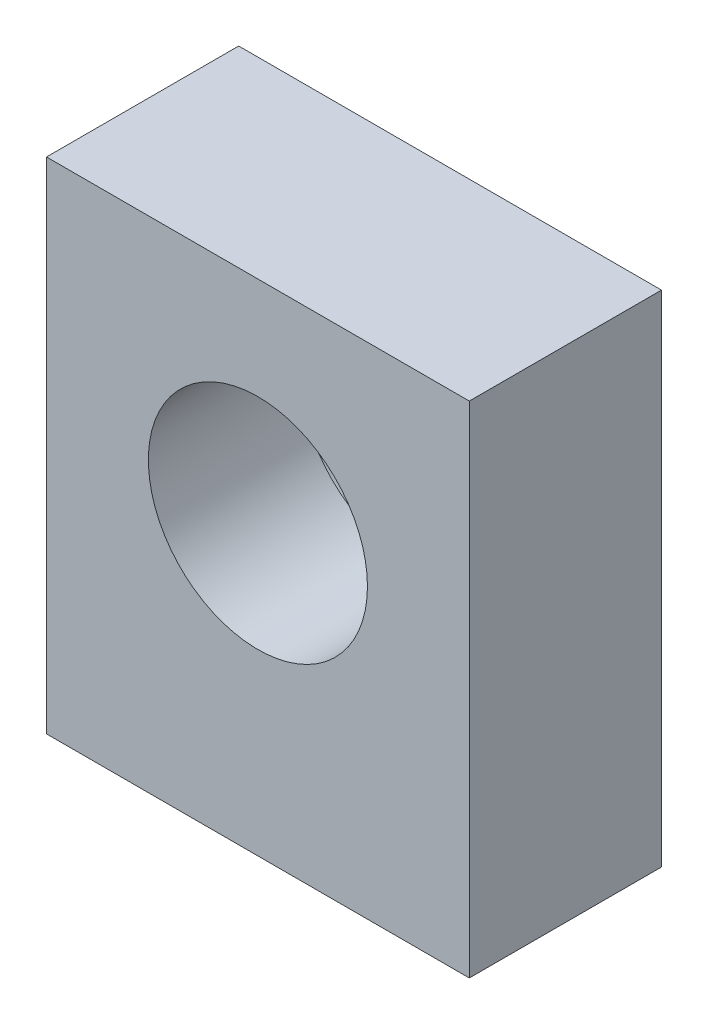
ISO-10303-21;
HEADER;
FILE_DESCRIPTION(('STEP AP214'),'2;1');
FILE_NAME('part.step','',(''),(''),'','','');
FILE_SCHEMA(('AUTOMOTIVE_DESIGN { 1 0 10303 214 1 1 1 1 }'));
ENDSEC;
DATA;
#1=APPLICATION_CONTEXT('core data for automotive mechanical design processes');
#2=APPLICATION_PROTOCOL_DEFINITION('international standard','automotive_design',2000,#1);
#3=PRODUCT_CONTEXT('',#1,'mechanical');
#4=PRODUCT('Part','Part','',(#3));
#5=PRODUCT_RELATED_PRODUCT_CATEGORY('part','',(#4));
#6=PRODUCT_DEFINITION_FORMATION('','',#4);
#7=PRODUCT_DEFINITION_CONTEXT('part definition',#1,'design');
#8=PRODUCT_DEFINITION('design','',#6,#7);
#9=PRODUCT_DEFINITION_SHAPE('','',#8);
#10=(LENGTH_UNIT() NAMED_UNIT(*) SI_UNIT(.MILLI.,.METRE.));
#11=(NAMED_UNIT(*) PLANE_ANGLE_UNIT() SI_UNIT($,.RADIAN.));
#12=(NAMED_UNIT(*) SI_UNIT($,.STERADIAN.) SOLID_ANGLE_UNIT());
#13=UNCERTAINTY_MEASURE_WITH_UNIT(LENGTH_MEASURE(1.E-05),#10,'distance_accuracy_value','');
#14=(GEOMETRIC_REPRESENTATION_CONTEXT(3) GLOBAL_UNCERTAINTY_ASSIGNED_CONTEXT((#13)) GLOBAL_UNIT_ASSIGNED_CONTEXT((#10,
#11,#12)) REPRESENTATION_CONTEXT('',''));
#15=CARTESIAN_POINT('',(0.,0.,0.));
#16=DIRECTION('',(0.,0.,1.));
#17=DIRECTION('',(1.,0.,0.));
#18=AXIS2_PLACEMENT_3D('',#15,#16,#17);
#19=CARTESIAN_POINT('',(11.,15.,-10.));
#20=DIRECTION('',(0.,0.,1.));
#21=DIRECTION('',(1.,0.,0.));
#22=AXIS2_PLACEMENT_3D('',#19,#20,#21);
#23=CYLINDRICAL_SURFACE('',#22,5.7);
#24=CARTESIAN_POINT('',(11.,15.,0.));
#25=DIRECTION('',(0.,0.,1.));
#26=DIRECTION('',(1.,0.,0.));
#27=AXIS2_PLACEMENT_3D('',#24,#25,#26);
#28=CIRCLE('',#27,5.7);
#29=CARTESIAN_POINT('',(16.7,15.,0.));
#30=VERTEX_POINT('',#29);
#31=EDGE_CURVE('E137',#30,#30,#28,.T.);
#32=ORIENTED_EDGE('',*,*,#31,.T.);
#33=EDGE_LOOP('',(#32));
#34=FACE_BOUND('',#33,.T.);
#35=CARTESIAN_POINT('',(11.,15.,-7.9));
#36=DIRECTION('',(0.,0.,-1.));
#37=DIRECTION('',(-1.,0.,0.));
#38=AXIS2_PLACEMENT_3D('',#35,#36,#37);
#39=CIRCLE('',#38,5.7);
#40=CARTESIAN_POINT('',(5.3,15.,-7.9));
#41=VERTEX_POINT('',#40);
#42=EDGE_CURVE('E41',#41,#41,#39,.F.);
#43=ORIENTED_EDGE('',*,*,#42,.F.);
#44=EDGE_LOOP('',(#43));
#45=FACE_BOUND('',#44,.T.);
#46=ADVANCED_FACE('F37',(#34,#45),#23,.F.);
#47=CARTESIAN_POINT('',(0.,26.,0.));
#48=DIRECTION('',(1.,0.,0.));
#49=DIRECTION('',(0.,0.,-1.));
#50=AXIS2_PLACEMENT_3D('',#47,#48,#49);
#51=PLANE('',#50);
#52=DIRECTION('',(0.,0.,1.));
#53=VECTOR('',#52,1.);
#54=CARTESIAN_POINT('',(0.,0.,0.));
#55=LINE('',#54,#53);
#56=CARTESIAN_POINT('',(0.,0.,-10.));
#57=VERTEX_POINT('',#56);
#58=CARTESIAN_POINT('',(0.,0.,0.));
#59=VERTEX_POINT('',#58);
#60=EDGE_CURVE('E140',#57,#59,#55,.T.);
#61=ORIENTED_EDGE('',*,*,#60,.T.);
#62=DIRECTION('',(0.,-1.,0.));
#63=VECTOR('',#62,1.);
#64=CARTESIAN_POINT('',(0.,26.,0.));
#65=LINE('',#64,#63);
#66=CARTESIAN_POINT('',(0.,26.,0.));
#67=VERTEX_POINT('',#66);
#68=EDGE_CURVE('E11',#67,#59,#65,.T.);
#69=ORIENTED_EDGE('',*,*,#68,.F.);
#70=DIRECTION('',(0.,0.,1.));
#71=VECTOR('',#70,1.);
#72=CARTESIAN_POINT('',(0.,26.,0.));
#73=LINE('',#72,#71);
#74=CARTESIAN_POINT('',(0.,26.,-10.));
#75=VERTEX_POINT('',#74);
#76=EDGE_CURVE('E141',#75,#67,#73,.T.);
#77=ORIENTED_EDGE('',*,*,#76,.F.);
#78=DIRECTION('',(0.,-1.,0.));
#79=VECTOR('',#78,1.);
#80=CARTESIAN_POINT('',(0.,26.,-10.));
#81=LINE('',#80,#79);
#82=EDGE_CURVE('E147',#75,#57,#81,.T.);
#83=ORIENTED_EDGE('',*,*,#82,.T.);
#84=EDGE_LOOP('',(#61,#69,#77,#83));
#85=FACE_BOUND('',#84,.T.);
#86=ADVANCED_FACE('F39',(#85),#51,.F.);
#87=CARTESIAN_POINT('',(0.,26.,0.));
#88=DIRECTION('',(0.,0.,-1.));
#89=DIRECTION('',(-1.,0.,0.));
#90=AXIS2_PLACEMENT_3D('',#87,#88,#89);
#91=PLANE('',#90);
#92=ORIENTED_EDGE('',*,*,#31,.F.);
#93=EDGE_LOOP('',(#92));
#94=FACE_BOUND('',#93,.T.);
#95=DIRECTION('',(1.,0.,0.));
#96=VECTOR('',#95,1.);
#97=CARTESIAN_POINT('',(0.,0.,0.));
#98=LINE('',#97,#96);
#99=CARTESIAN_POINT('',(22.,0.,0.));
#100=VERTEX_POINT('',#99);
#101=EDGE_CURVE('E150',#59,#100,#98,.T.);
#102=ORIENTED_EDGE('',*,*,#101,.T.);
#103=DIRECTION('',(0.,-1.,0.));
#104=VECTOR('',#103,1.);
#105=CARTESIAN_POINT('',(22.,26.,0.));
#106=LINE('',#105,#104);
#107=CARTESIAN_POINT('',(22.,26.,0.));
#108=VERTEX_POINT('',#107);
#109=EDGE_CURVE('E47',#108,#100,#106,.T.);
#110=ORIENTED_EDGE('',*,*,#109,.F.);
#111=DIRECTION('',(1.,0.,0.));
#112=VECTOR('',#111,1.);
#113=CARTESIAN_POINT('',(0.,26.,0.));
#114=LINE('',#113,#112);
#115=EDGE_CURVE('E86',#67,#108,#114,.T.);
#116=ORIENTED_EDGE('',*,*,#115,.F.);
#117=ORIENTED_EDGE('',*,*,#68,.T.);
#118=EDGE_LOOP('',(#102,#110,#116,#117));
#119=FACE_BOUND('',#118,.T.);
#120=ADVANCED_FACE('F175',(#94,#119),#91,.F.);
#121=CARTESIAN_POINT('',(22.,26.,0.));
#122=DIRECTION('',(-1.,0.,0.));
#123=DIRECTION('',(0.,0.,1.));
#124=AXIS2_PLACEMENT_3D('',#121,#122,#123);
#125=PLANE('',#124);
#126=DIRECTION('',(0.,0.,-1.));
#127=VECTOR('',#126,1.);
#128=CARTESIAN_POINT('',(22.,0.,0.));
#129=LINE('',#128,#127);
#130=CARTESIAN_POINT('',(22.,0.,-10.));
#131=VERTEX_POINT('',#130);
#132=EDGE_CURVE('E73',#100,#131,#129,.T.);
#133=ORIENTED_EDGE('',*,*,#132,.T.);
#134=DIRECTION('',(0.,-1.,0.));
#135=VECTOR('',#134,1.);
#136=CARTESIAN_POINT('',(22.,26.,-10.));
#137=LINE('',#136,#135);
#138=CARTESIAN_POINT('',(22.,26.,-10.));
#139=VERTEX_POINT('',#138);
#140=EDGE_CURVE('E155',#139,#131,#137,.T.);
#141=ORIENTED_EDGE('',*,*,#140,.F.);
#142=DIRECTION('',(0.,0.,-1.));
#143=VECTOR('',#142,1.);
#144=CARTESIAN_POINT('',(22.,26.,0.));
#145=LINE('',#144,#143);
#146=EDGE_CURVE('E144',#108,#139,#145,.T.);
#147=ORIENTED_EDGE('',*,*,#146,.F.);
#148=ORIENTED_EDGE('',*,*,#109,.T.);
#149=EDGE_LOOP('',(#133,#141,#147,#148));
#150=FACE_BOUND('',#149,.T.);
#151=ADVANCED_FACE('F158',(#150),#125,.F.);
#152=CARTESIAN_POINT('',(0.,26.,-10.));
#153=DIRECTION('',(0.,0.,1.));
#154=DIRECTION('',(1.,0.,0.));
#155=AXIS2_PLACEMENT_3D('',#152,#153,#154);
#156=PLANE('',#155);
#157=CARTESIAN_POINT('',(11.,15.,-10.));
#158=DIRECTION('',(0.,0.,-1.));
#159=DIRECTION('',(-1.,0.,0.));
#160=AXIS2_PLACEMENT_3D('',#157,#158,#159);
#161=CIRCLE('',#160,8.05);
#162=CARTESIAN_POINT('',(2.95,15.,-10.));
#163=VERTEX_POINT('',#162);
#164=EDGE_CURVE('E131',#163,#163,#161,.T.);
#165=ORIENTED_EDGE('',*,*,#164,.F.);
#166=EDGE_LOOP('',(#165));
#167=FACE_BOUND('',#166,.T.);
#168=DIRECTION('',(-1.,0.,0.));
#169=VECTOR('',#168,1.);
#170=CARTESIAN_POINT('',(0.,0.,-10.));
#171=LINE('',#170,#169);
#172=EDGE_CURVE('E79',#131,#57,#171,.T.);
#173=ORIENTED_EDGE('',*,*,#172,.T.);
#174=ORIENTED_EDGE('',*,*,#82,.F.);
#175=DIRECTION('',(-1.,0.,0.));
#176=VECTOR('',#175,1.);
#177=CARTESIAN_POINT('',(0.,26.,-10.));
#178=LINE('',#177,#176);
#179=EDGE_CURVE('E55',#139,#75,#178,.T.);
#180=ORIENTED_EDGE('',*,*,#179,.F.);
#181=ORIENTED_EDGE('',*,*,#140,.T.);
#182=EDGE_LOOP('',(#173,#174,#180,#181));
#183=FACE_BOUND('',#182,.T.);
#184=ADVANCED_FACE('F165',(#167,#183),#156,.F.);
#185=CARTESIAN_POINT('',(0.,26.,0.));
#186=DIRECTION('',(0.,-1.,0.));
#187=DIRECTION('',(0.,0.,-1.));
#188=AXIS2_PLACEMENT_3D('',#185,#186,#187);
#189=PLANE('',#188);
#190=ORIENTED_EDGE('',*,*,#76,.T.);
#191=ORIENTED_EDGE('',*,*,#115,.T.);
#192=ORIENTED_EDGE('',*,*,#146,.T.);
#193=ORIENTED_EDGE('',*,*,#179,.T.);
#194=EDGE_LOOP('',(#190,#191,#192,#193));
#195=FACE_BOUND('',#194,.T.);
#196=ADVANCED_FACE('F167',(#195),#189,.F.);
#197=CARTESIAN_POINT('',(0.,0.,0.));
#198=DIRECTION('',(0.,-1.,0.));
#199=DIRECTION('',(0.,0.,-1.));
#200=AXIS2_PLACEMENT_3D('',#197,#198,#199);
#201=PLANE('',#200);
#202=CARTESIAN_POINT('',(3.,0.,-3.));
#203=DIRECTION('',(0.,-1.,0.));
#204=DIRECTION('',(0.,0.,-1.));
#205=AXIS2_PLACEMENT_3D('',#202,#203,#204);
#206=CIRCLE('',#205,1.525);
#207=CARTESIAN_POINT('',(3.,0.,-4.525));
#208=VERTEX_POINT('',#207);
#209=EDGE_CURVE('E113',#208,#208,#206,.T.);
#210=ORIENTED_EDGE('',*,*,#209,.F.);
#211=EDGE_LOOP('',(#210));
#212=FACE_BOUND('',#211,.T.);
#213=CARTESIAN_POINT('',(19.,0.,-3.));
#214=DIRECTION('',(0.,-1.,0.));
#215=DIRECTION('',(0.,0.,-1.));
#216=AXIS2_PLACEMENT_3D('',#213,#214,#215);
#217=CIRCLE('',#216,1.525);
#218=CARTESIAN_POINT('',(19.,0.,-4.525));
#219=VERTEX_POINT('',#218);
#220=EDGE_CURVE('E106',#219,#219,#217,.T.);
#221=ORIENTED_EDGE('',*,*,#220,.F.);
#222=EDGE_LOOP('',(#221));
#223=FACE_BOUND('',#222,.T.);
#224=CARTESIAN_POINT('',(11.,0.,-7.));
#225=DIRECTION('',(0.,-1.,0.));
#226=DIRECTION('',(0.,0.,-1.));
#227=AXIS2_PLACEMENT_3D('',#224,#225,#226);
#228=CIRCLE('',#227,1.525);
#229=CARTESIAN_POINT('',(11.,0.,-8.525));
#230=VERTEX_POINT('',#229);
#231=EDGE_CURVE('E122',#230,#230,#228,.T.);
#232=ORIENTED_EDGE('',*,*,#231,.F.);
#233=EDGE_LOOP('',(#232));
#234=FACE_BOUND('',#233,.T.);
#235=ORIENTED_EDGE('',*,*,#60,.F.);
#236=ORIENTED_EDGE('',*,*,#172,.F.);
#237=ORIENTED_EDGE('',*,*,#132,.F.);
#238=ORIENTED_EDGE('',*,*,#101,.F.);
#239=EDGE_LOOP('',(#235,#236,#237,#238));
#240=FACE_BOUND('',#239,.T.);
#241=ADVANCED_FACE('F161',(#212,#223,#234,#240),#201,.T.);
#242=CARTESIAN_POINT('',(11.,15.,-7.9));
#243=DIRECTION('',(0.,0.,-1.));
#244=DIRECTION('',(-1.,0.,0.));
#245=AXIS2_PLACEMENT_3D('',#242,#243,#244);
#246=PLANE('',#245);
#247=CARTESIAN_POINT('',(11.,15.,-7.9));
#248=DIRECTION('',(0.,0.,-1.));
#249=DIRECTION('',(-1.,0.,0.));
#250=AXIS2_PLACEMENT_3D('',#247,#248,#249);
#251=CIRCLE('',#250,8.05);
#252=CARTESIAN_POINT('',(2.95,15.,-7.9));
#253=VERTEX_POINT('',#252);
#254=EDGE_CURVE('E132',#253,#253,#251,.T.);
#255=ORIENTED_EDGE('',*,*,#254,.T.);
#256=EDGE_LOOP('',(#255));
#257=FACE_BOUND('',#256,.T.);
#258=ORIENTED_EDGE('',*,*,#42,.T.);
#259=EDGE_LOOP('',(#258));
#260=FACE_BOUND('',#259,.T.);
#261=ADVANCED_FACE('F190',(#257,#260),#246,.T.);
#262=CARTESIAN_POINT('',(11.,15.,-7.9));
#263=DIRECTION('',(0.,0.,-1.));
#264=DIRECTION('',(-1.,0.,0.));
#265=AXIS2_PLACEMENT_3D('',#262,#263,#264);
#266=CYLINDRICAL_SURFACE('',#265,8.05);
#267=ORIENTED_EDGE('',*,*,#254,.F.);
#268=EDGE_LOOP('',(#267));
#269=FACE_BOUND('',#268,.T.);
#270=ORIENTED_EDGE('',*,*,#164,.T.);
#271=EDGE_LOOP('',(#270));
#272=FACE_BOUND('',#271,.T.);
#273=ADVANCED_FACE('F187',(#269,#272),#266,.F.);
#274=CARTESIAN_POINT('',(11.,5.,-7.));
#275=DIRECTION('',(0.,-1.,0.));
#276=DIRECTION('',(0.,0.,-1.));
#277=AXIS2_PLACEMENT_3D('',#274,#275,#276);
#278=CONICAL_SURFACE('',#277,1.25,1.02974425867665);
#279=CARTESIAN_POINT('',(11.,5.75107577378445,-7.));
#280=VERTEX_POINT('',#279);
#281=VERTEX_LOOP('',#280);
#282=FACE_BOUND('',#281,.T.);
#283=CARTESIAN_POINT('',(11.,5.,-7.));
#284=DIRECTION('',(0.,-1.,0.));
#285=DIRECTION('',(0.,0.,-1.));
#286=AXIS2_PLACEMENT_3D('',#283,#284,#285);
#287=CIRCLE('',#286,1.25);
#288=CARTESIAN_POINT('',(11.,5.,-8.25));
#289=VERTEX_POINT('',#288);
#290=EDGE_CURVE('E128',#289,#289,#287,.T.);
#291=ORIENTED_EDGE('',*,*,#290,.T.);
#292=EDGE_LOOP('',(#291));
#293=FACE_BOUND('',#292,.T.);
#294=ADVANCED_FACE('F216',(#282,#293),#278,.F.);
#295=CARTESIAN_POINT('',(11.,0.,-7.));
#296=DIRECTION('',(0.,-1.,0.));
#297=DIRECTION('',(0.,0.,-1.));
#298=AXIS2_PLACEMENT_3D('',#295,#296,#297);
#299=CYLINDRICAL_SURFACE('',#298,1.25);
#300=ORIENTED_EDGE('',*,*,#290,.F.);
#301=EDGE_LOOP('',(#300));
#302=FACE_BOUND('',#301,.T.);
#303=CARTESIAN_POINT('',(11.,0.275000000000002,-7.));
#304=DIRECTION('',(0.,-1.,0.));
#305=DIRECTION('',(0.,0.,-1.));
#306=AXIS2_PLACEMENT_3D('',#303,#304,#305);
#307=CIRCLE('',#306,1.25);
#308=CARTESIAN_POINT('',(11.,0.275000000000002,-8.25));
#309=VERTEX_POINT('',#308);
#310=EDGE_CURVE('E125',#309,#309,#307,.T.);
#311=ORIENTED_EDGE('',*,*,#310,.T.);
#312=EDGE_LOOP('',(#311));
#313=FACE_BOUND('',#312,.T.);
#314=ADVANCED_FACE('F206',(#302,#313),#299,.F.);
#315=CARTESIAN_POINT('',(11.,0.,-7.));
#316=DIRECTION('',(0.,-1.,0.));
#317=DIRECTION('',(0.,0.,-1.));
#318=AXIS2_PLACEMENT_3D('',#315,#316,#317);
#319=CONICAL_SURFACE('',#318,1.525,0.785398163397444);
#320=ORIENTED_EDGE('',*,*,#310,.F.);
#321=EDGE_LOOP('',(#320));
#322=FACE_BOUND('',#321,.T.);
#323=ORIENTED_EDGE('',*,*,#231,.T.);
#324=EDGE_LOOP('',(#323));
#325=FACE_BOUND('',#324,.T.);
#326=ADVANCED_FACE('F203',(#322,#325),#319,.F.);
#327=CARTESIAN_POINT('',(19.,5.,-3.));
#328=DIRECTION('',(0.,-1.,0.));
#329=DIRECTION('',(0.,0.,-1.));
#330=AXIS2_PLACEMENT_3D('',#327,#328,#329);
#331=CONICAL_SURFACE('',#330,1.25,1.02974425867665);
#332=CARTESIAN_POINT('',(19.,5.75107577378445,-3.));
#333=VERTEX_POINT('',#332);
#334=VERTEX_LOOP('',#333);
#335=FACE_BOUND('',#334,.T.);
#336=CARTESIAN_POINT('',(19.,5.,-3.));
#337=DIRECTION('',(0.,-1.,0.));
#338=DIRECTION('',(0.,0.,-1.));
#339=AXIS2_PLACEMENT_3D('',#336,#337,#338);
#340=CIRCLE('',#339,1.25);
#341=CARTESIAN_POINT('',(19.,5.,-4.25));
#342=VERTEX_POINT('',#341);
#343=EDGE_CURVE('E119',#342,#342,#340,.T.);
#344=ORIENTED_EDGE('',*,*,#343,.T.);
#345=EDGE_LOOP('',(#344));
#346=FACE_BOUND('',#345,.T.);
#347=ADVANCED_FACE('F205',(#335,#346),#331,.F.);
#348=CARTESIAN_POINT('',(19.,0.,-3.));
#349=DIRECTION('',(0.,-1.,0.));
#350=DIRECTION('',(0.,0.,-1.));
#351=AXIS2_PLACEMENT_3D('',#348,#349,#350);
#352=CYLINDRICAL_SURFACE('',#351,1.25);
#353=ORIENTED_EDGE('',*,*,#343,.F.);
#354=EDGE_LOOP('',(#353));
#355=FACE_BOUND('',#354,.T.);
#356=CARTESIAN_POINT('',(19.,0.275000000000002,-3.));
#357=DIRECTION('',(0.,-1.,0.));
#358=DIRECTION('',(0.,0.,-1.));
#359=AXIS2_PLACEMENT_3D('',#356,#357,#358);
#360=CIRCLE('',#359,1.25);
#361=CARTESIAN_POINT('',(19.,0.275000000000002,-4.25));
#362=VERTEX_POINT('',#361);
#363=EDGE_CURVE('E110',#362,#362,#360,.T.);
#364=ORIENTED_EDGE('',*,*,#363,.T.);
#365=EDGE_LOOP('',(#364));
#366=FACE_BOUND('',#365,.T.);
#367=ADVANCED_FACE('F213',(#355,#366),#352,.F.);
#368=CARTESIAN_POINT('',(19.,0.,-3.));
#369=DIRECTION('',(0.,-1.,0.));
#370=DIRECTION('',(0.,0.,-1.));
#371=AXIS2_PLACEMENT_3D('',#368,#369,#370);
#372=CONICAL_SURFACE('',#371,1.525,0.78539816339745);
#373=ORIENTED_EDGE('',*,*,#363,.F.);
#374=EDGE_LOOP('',(#373));
#375=FACE_BOUND('',#374,.T.);
#376=ORIENTED_EDGE('',*,*,#220,.T.);
#377=EDGE_LOOP('',(#376));
#378=FACE_BOUND('',#377,.T.);
#379=ADVANCED_FACE('F100',(#375,#378),#372,.F.);
#380=CARTESIAN_POINT('',(3.,5.,-3.));
#381=DIRECTION('',(0.,-1.,0.));
#382=DIRECTION('',(0.,0.,-1.));
#383=AXIS2_PLACEMENT_3D('',#380,#381,#382);
#384=CONICAL_SURFACE('',#383,1.25,1.02974425867665);
#385=CARTESIAN_POINT('',(3.,5.75107577378445,-3.));
#386=VERTEX_POINT('',#385);
#387=VERTEX_LOOP('',#386);
#388=FACE_BOUND('',#387,.T.);
#389=CARTESIAN_POINT('',(3.,5.,-3.));
#390=DIRECTION('',(0.,-1.,0.));
#391=DIRECTION('',(0.,0.,-1.));
#392=AXIS2_PLACEMENT_3D('',#389,#390,#391);
#393=CIRCLE('',#392,1.25);
#394=CARTESIAN_POINT('',(3.,5.,-4.25));
#395=VERTEX_POINT('',#394);
#396=EDGE_CURVE('E104',#395,#395,#393,.T.);
#397=ORIENTED_EDGE('',*,*,#396,.T.);
#398=EDGE_LOOP('',(#397));
#399=FACE_BOUND('',#398,.T.);
#400=ADVANCED_FACE('F96',(#388,#399),#384,.F.);
#401=CARTESIAN_POINT('',(3.,0.,-3.));
#402=DIRECTION('',(0.,-1.,0.));
#403=DIRECTION('',(0.,0.,-1.));
#404=AXIS2_PLACEMENT_3D('',#401,#402,#403);
#405=CYLINDRICAL_SURFACE('',#404,1.25);
#406=ORIENTED_EDGE('',*,*,#396,.F.);
#407=EDGE_LOOP('',(#406));
#408=FACE_BOUND('',#407,.T.);
#409=CARTESIAN_POINT('',(3.,0.275000000000002,-3.));
#410=DIRECTION('',(0.,-1.,0.));
#411=DIRECTION('',(0.,0.,-1.));
#412=AXIS2_PLACEMENT_3D('',#409,#410,#411);
#413=CIRCLE('',#412,1.25);
#414=CARTESIAN_POINT('',(3.,0.275000000000002,-4.25));
#415=VERTEX_POINT('',#414);
#416=EDGE_CURVE('E107',#415,#415,#413,.T.);
#417=ORIENTED_EDGE('',*,*,#416,.T.);
#418=EDGE_LOOP('',(#417));
#419=FACE_BOUND('',#418,.T.);
#420=ADVANCED_FACE('F99',(#408,#419),#405,.F.);
#421=CARTESIAN_POINT('',(3.,0.,-3.));
#422=DIRECTION('',(0.,-1.,0.));
#423=DIRECTION('',(0.,0.,-1.));
#424=AXIS2_PLACEMENT_3D('',#421,#422,#423);
#425=CONICAL_SURFACE('',#424,1.525,0.785398163397444);
#426=ORIENTED_EDGE('',*,*,#416,.F.);
#427=EDGE_LOOP('',(#426));
#428=FACE_BOUND('',#427,.T.);
#429=ORIENTED_EDGE('',*,*,#209,.T.);
#430=EDGE_LOOP('',(#429));
#431=FACE_BOUND('',#430,.T.);
#432=ADVANCED_FACE('F337',(#428,#431),#425,.F.);
#433=CLOSED_SHELL('',(#46,#86,#120,#151,#184,#196,#241,#261,#273,#294,#314,#326,#347,#367,#379,
#400,#420,#432));
#434=MANIFOLD_SOLID_BREP('B2',#433);
#435=ADVANCED_BREP_SHAPE_REPRESENTATION('',(#18,#434),#14);
#436=SHAPE_DEFINITION_REPRESENTATION(#9,#435);
ENDSEC;
END-ISO-10303-21;
